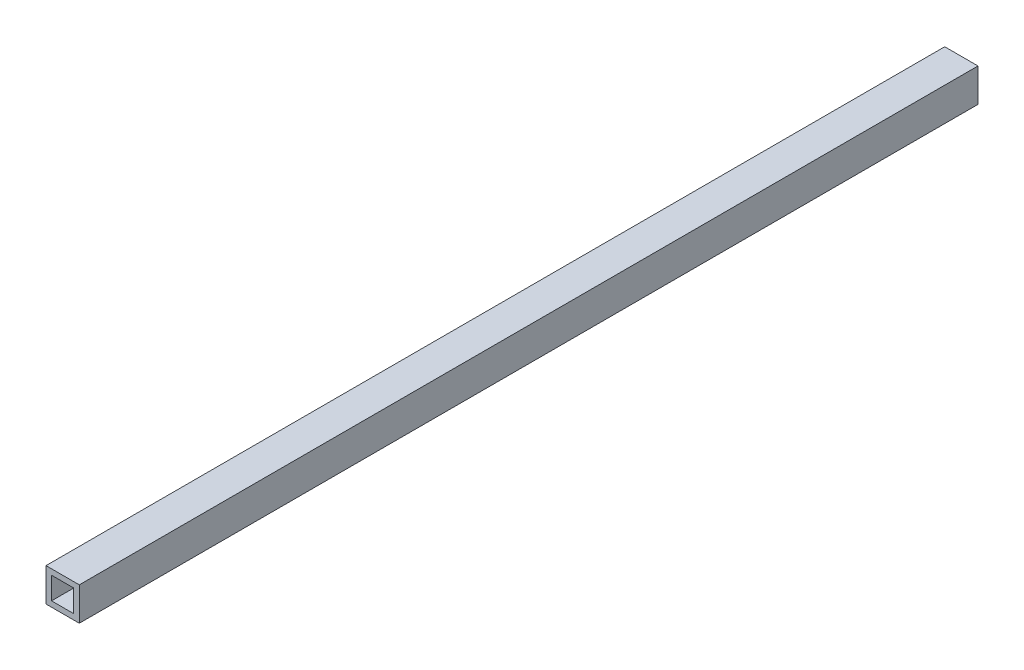
ISO-10303-21;
HEADER;
FILE_DESCRIPTION(('STEP AP214'),'2;1');
FILE_NAME('part.step','',(''),(''),'','','');
FILE_SCHEMA(('AUTOMOTIVE_DESIGN { 1 0 10303 214 1 1 1 1 }'));
ENDSEC;
DATA;
#1=APPLICATION_CONTEXT('core data for automotive mechanical design processes');
#2=APPLICATION_PROTOCOL_DEFINITION('international standard','automotive_design',2000,#1);
#3=PRODUCT_CONTEXT('',#1,'mechanical');
#4=PRODUCT('Part','Part','',(#3));
#5=PRODUCT_RELATED_PRODUCT_CATEGORY('part','',(#4));
#6=PRODUCT_DEFINITION_FORMATION('','',#4);
#7=PRODUCT_DEFINITION_CONTEXT('part definition',#1,'design');
#8=PRODUCT_DEFINITION('design','',#6,#7);
#9=PRODUCT_DEFINITION_SHAPE('','',#8);
#10=(LENGTH_UNIT() NAMED_UNIT(*) SI_UNIT(.MILLI.,.METRE.));
#11=(NAMED_UNIT(*) PLANE_ANGLE_UNIT() SI_UNIT($,.RADIAN.));
#12=(NAMED_UNIT(*) SI_UNIT($,.STERADIAN.) SOLID_ANGLE_UNIT());
#13=UNCERTAINTY_MEASURE_WITH_UNIT(LENGTH_MEASURE(1.E-05),#10,'distance_accuracy_value','');
#14=(GEOMETRIC_REPRESENTATION_CONTEXT(3) GLOBAL_UNCERTAINTY_ASSIGNED_CONTEXT((#13)) GLOBAL_UNIT_ASSIGNED_CONTEXT((#10,
#11,#12)) REPRESENTATION_CONTEXT('',''));
#15=CARTESIAN_POINT('',(0.,0.,0.));
#16=DIRECTION('',(0.,0.,1.));
#17=DIRECTION('',(1.,0.,0.));
#18=AXIS2_PLACEMENT_3D('',#15,#16,#17);
#19=CARTESIAN_POINT('',(9.52500000000001,-9.52499999999999,-514.35));
#20=DIRECTION('',(1.,0.,0.));
#21=DIRECTION('',(0.,0.,-1.));
#22=AXIS2_PLACEMENT_3D('',#19,#20,#21);
#23=PLANE('',#22);
#24=DIRECTION('',(0.,1.,0.));
#25=VECTOR('',#24,1.);
#26=CARTESIAN_POINT('',(9.52500000000001,-9.52499999999999,0.));
#27=LINE('',#26,#25);
#28=CARTESIAN_POINT('',(9.52500000000001,-9.52499999999999,0.));
#29=VERTEX_POINT('',#28);
#30=CARTESIAN_POINT('',(9.52500000000001,9.52500000000001,0.));
#31=VERTEX_POINT('',#30);
#32=EDGE_CURVE('E104',#29,#31,#27,.T.);
#33=ORIENTED_EDGE('',*,*,#32,.F.);
#34=DIRECTION('',(0.,0.,1.));
#35=VECTOR('',#34,1.);
#36=CARTESIAN_POINT('',(9.52500000000001,-9.52499999999999,-514.35));
#37=LINE('',#36,#35);
#38=CARTESIAN_POINT('',(9.52500000000001,-9.52499999999999,-514.35));
#39=VERTEX_POINT('',#38);
#40=EDGE_CURVE('E11',#39,#29,#37,.T.);
#41=ORIENTED_EDGE('',*,*,#40,.F.);
#42=DIRECTION('',(0.,1.,0.));
#43=VECTOR('',#42,1.);
#44=CARTESIAN_POINT('',(9.52500000000001,-9.52499999999999,-514.35));
#45=LINE('',#44,#43);
#46=CARTESIAN_POINT('',(9.52500000000001,9.52500000000001,-514.35));
#47=VERTEX_POINT('',#46);
#48=EDGE_CURVE('E133',#39,#47,#45,.T.);
#49=ORIENTED_EDGE('',*,*,#48,.T.);
#50=DIRECTION('',(0.,0.,1.));
#51=VECTOR('',#50,1.);
#52=CARTESIAN_POINT('',(9.52500000000001,9.52500000000001,-514.35));
#53=LINE('',#52,#51);
#54=EDGE_CURVE('E36',#47,#31,#53,.T.);
#55=ORIENTED_EDGE('',*,*,#54,.T.);
#56=EDGE_LOOP('',(#33,#41,#49,#55));
#57=FACE_BOUND('',#56,.T.);
#58=ADVANCED_FACE('F33',(#57),#23,.T.);
#59=CARTESIAN_POINT('',(-9.525,-9.52499999999999,-514.35));
#60=DIRECTION('',(0.,-1.,0.));
#61=DIRECTION('',(0.,0.,-1.));
#62=AXIS2_PLACEMENT_3D('',#59,#60,#61);
#63=PLANE('',#62);
#64=DIRECTION('',(1.,0.,0.));
#65=VECTOR('',#64,1.);
#66=CARTESIAN_POINT('',(-9.525,-9.52499999999999,0.));
#67=LINE('',#66,#65);
#68=CARTESIAN_POINT('',(-9.525,-9.52499999999999,0.));
#69=VERTEX_POINT('',#68);
#70=EDGE_CURVE('E137',#69,#29,#67,.T.);
#71=ORIENTED_EDGE('',*,*,#70,.F.);
#72=DIRECTION('',(0.,0.,1.));
#73=VECTOR('',#72,1.);
#74=CARTESIAN_POINT('',(-9.525,-9.52499999999999,-514.35));
#75=LINE('',#74,#73);
#76=CARTESIAN_POINT('',(-9.525,-9.52499999999999,-514.35));
#77=VERTEX_POINT('',#76);
#78=EDGE_CURVE('E41',#77,#69,#75,.T.);
#79=ORIENTED_EDGE('',*,*,#78,.F.);
#80=DIRECTION('',(1.,0.,0.));
#81=VECTOR('',#80,1.);
#82=CARTESIAN_POINT('',(-9.525,-9.52499999999999,-514.35));
#83=LINE('',#82,#81);
#84=EDGE_CURVE('E143',#77,#39,#83,.T.);
#85=ORIENTED_EDGE('',*,*,#84,.T.);
#86=ORIENTED_EDGE('',*,*,#40,.T.);
#87=EDGE_LOOP('',(#71,#79,#85,#86));
#88=FACE_BOUND('',#87,.T.);
#89=ADVANCED_FACE('F169',(#88),#63,.T.);
#90=CARTESIAN_POINT('',(-9.525,-9.52499999999999,-514.35));
#91=DIRECTION('',(-1.,0.,0.));
#92=DIRECTION('',(0.,0.,1.));
#93=AXIS2_PLACEMENT_3D('',#90,#91,#92);
#94=PLANE('',#93);
#95=DIRECTION('',(0.,-1.,0.));
#96=VECTOR('',#95,1.);
#97=CARTESIAN_POINT('',(-9.525,-9.52499999999999,0.));
#98=LINE('',#97,#96);
#99=CARTESIAN_POINT('',(-9.525,9.52500000000001,0.));
#100=VERTEX_POINT('',#99);
#101=EDGE_CURVE('E151',#100,#69,#98,.T.);
#102=ORIENTED_EDGE('',*,*,#101,.F.);
#103=DIRECTION('',(0.,0.,1.));
#104=VECTOR('',#103,1.);
#105=CARTESIAN_POINT('',(-9.525,9.52500000000001,-514.35));
#106=LINE('',#105,#104);
#107=CARTESIAN_POINT('',(-9.525,9.52500000000001,-514.35));
#108=VERTEX_POINT('',#107);
#109=EDGE_CURVE('E156',#108,#100,#106,.T.);
#110=ORIENTED_EDGE('',*,*,#109,.F.);
#111=DIRECTION('',(0.,-1.,0.));
#112=VECTOR('',#111,1.);
#113=CARTESIAN_POINT('',(-9.525,-9.52499999999999,-514.35));
#114=LINE('',#113,#112);
#115=EDGE_CURVE('E140',#108,#77,#114,.T.);
#116=ORIENTED_EDGE('',*,*,#115,.T.);
#117=ORIENTED_EDGE('',*,*,#78,.T.);
#118=EDGE_LOOP('',(#102,#110,#116,#117));
#119=FACE_BOUND('',#118,.T.);
#120=ADVANCED_FACE('F173',(#119),#94,.T.);
#121=CARTESIAN_POINT('',(-9.525,9.52500000000001,-514.35));
#122=DIRECTION('',(0.,1.,0.));
#123=DIRECTION('',(0.,0.,1.));
#124=AXIS2_PLACEMENT_3D('',#121,#122,#123);
#125=PLANE('',#124);
#126=DIRECTION('',(-1.,0.,0.));
#127=VECTOR('',#126,1.);
#128=CARTESIAN_POINT('',(-9.525,9.52500000000001,0.));
#129=LINE('',#128,#127);
#130=EDGE_CURVE('E148',#31,#100,#129,.T.);
#131=ORIENTED_EDGE('',*,*,#130,.F.);
#132=ORIENTED_EDGE('',*,*,#54,.F.);
#133=DIRECTION('',(-1.,0.,0.));
#134=VECTOR('',#133,1.);
#135=CARTESIAN_POINT('',(-9.525,9.52500000000001,-514.35));
#136=LINE('',#135,#134);
#137=EDGE_CURVE('E136',#47,#108,#136,.T.);
#138=ORIENTED_EDGE('',*,*,#137,.T.);
#139=ORIENTED_EDGE('',*,*,#109,.T.);
#140=EDGE_LOOP('',(#131,#132,#138,#139));
#141=FACE_BOUND('',#140,.T.);
#142=ADVANCED_FACE('F164',(#141),#125,.T.);
#143=CARTESIAN_POINT('',(0.,0.,-514.35));
#144=DIRECTION('',(0.,0.,-1.));
#145=DIRECTION('',(-1.,0.,0.));
#146=AXIS2_PLACEMENT_3D('',#143,#144,#145);
#147=PLANE('',#146);
#148=DIRECTION('',(0.,1.,0.));
#149=VECTOR('',#148,1.);
#150=CARTESIAN_POINT('',(6.35,-6.35,-514.35));
#151=LINE('',#150,#149);
#152=CARTESIAN_POINT('',(6.35,-6.35,-514.35));
#153=VERTEX_POINT('',#152);
#154=CARTESIAN_POINT('',(6.35,6.35,-514.35));
#155=VERTEX_POINT('',#154);
#156=EDGE_CURVE('E108',#153,#155,#151,.T.);
#157=ORIENTED_EDGE('',*,*,#156,.T.);
#158=DIRECTION('',(-1.,0.,0.));
#159=VECTOR('',#158,1.);
#160=CARTESIAN_POINT('',(-6.35,6.35,-514.35));
#161=LINE('',#160,#159);
#162=CARTESIAN_POINT('',(-6.35,6.35,-514.35));
#163=VERTEX_POINT('',#162);
#164=EDGE_CURVE('E97',#155,#163,#161,.T.);
#165=ORIENTED_EDGE('',*,*,#164,.T.);
#166=DIRECTION('',(0.,-1.,0.));
#167=VECTOR('',#166,1.);
#168=CARTESIAN_POINT('',(-6.35,-6.35,-514.35));
#169=LINE('',#168,#167);
#170=CARTESIAN_POINT('',(-6.35,-6.35,-514.35));
#171=VERTEX_POINT('',#170);
#172=EDGE_CURVE('E119',#163,#171,#169,.T.);
#173=ORIENTED_EDGE('',*,*,#172,.T.);
#174=DIRECTION('',(1.,0.,0.));
#175=VECTOR('',#174,1.);
#176=CARTESIAN_POINT('',(-6.35,-6.35,-514.35));
#177=LINE('',#176,#175);
#178=EDGE_CURVE('E115',#171,#153,#177,.T.);
#179=ORIENTED_EDGE('',*,*,#178,.T.);
#180=EDGE_LOOP('',(#157,#165,#173,#179));
#181=FACE_BOUND('',#180,.T.);
#182=ORIENTED_EDGE('',*,*,#48,.F.);
#183=ORIENTED_EDGE('',*,*,#84,.F.);
#184=ORIENTED_EDGE('',*,*,#115,.F.);
#185=ORIENTED_EDGE('',*,*,#137,.F.);
#186=EDGE_LOOP('',(#182,#183,#184,#185));
#187=FACE_BOUND('',#186,.T.);
#188=ADVANCED_FACE('F113',(#181,#187),#147,.T.);
#189=CARTESIAN_POINT('',(0.,0.,0.));
#190=DIRECTION('',(0.,0.,-1.));
#191=DIRECTION('',(-1.,0.,0.));
#192=AXIS2_PLACEMENT_3D('',#189,#190,#191);
#193=PLANE('',#192);
#194=DIRECTION('',(-1.,0.,0.));
#195=VECTOR('',#194,1.);
#196=CARTESIAN_POINT('',(-6.35,6.35,0.));
#197=LINE('',#196,#195);
#198=CARTESIAN_POINT('',(6.35,6.35,0.));
#199=VERTEX_POINT('',#198);
#200=CARTESIAN_POINT('',(-6.35,6.35,0.));
#201=VERTEX_POINT('',#200);
#202=EDGE_CURVE('E117',#199,#201,#197,.T.);
#203=ORIENTED_EDGE('',*,*,#202,.F.);
#204=DIRECTION('',(0.,1.,0.));
#205=VECTOR('',#204,1.);
#206=CARTESIAN_POINT('',(6.35,-6.35,0.));
#207=LINE('',#206,#205);
#208=CARTESIAN_POINT('',(6.35,-6.35,0.));
#209=VERTEX_POINT('',#208);
#210=EDGE_CURVE('E57',#209,#199,#207,.T.);
#211=ORIENTED_EDGE('',*,*,#210,.F.);
#212=DIRECTION('',(1.,0.,0.));
#213=VECTOR('',#212,1.);
#214=CARTESIAN_POINT('',(-6.35,-6.35,0.));
#215=LINE('',#214,#213);
#216=CARTESIAN_POINT('',(-6.35,-6.35,0.));
#217=VERTEX_POINT('',#216);
#218=EDGE_CURVE('E110',#217,#209,#215,.T.);
#219=ORIENTED_EDGE('',*,*,#218,.F.);
#220=DIRECTION('',(0.,-1.,0.));
#221=VECTOR('',#220,1.);
#222=CARTESIAN_POINT('',(-6.35,-6.35,0.));
#223=LINE('',#222,#221);
#224=EDGE_CURVE('E124',#201,#217,#223,.T.);
#225=ORIENTED_EDGE('',*,*,#224,.F.);
#226=EDGE_LOOP('',(#203,#211,#219,#225));
#227=FACE_BOUND('',#226,.T.);
#228=ORIENTED_EDGE('',*,*,#32,.T.);
#229=ORIENTED_EDGE('',*,*,#130,.T.);
#230=ORIENTED_EDGE('',*,*,#101,.T.);
#231=ORIENTED_EDGE('',*,*,#70,.T.);
#232=EDGE_LOOP('',(#228,#229,#230,#231));
#233=FACE_BOUND('',#232,.T.);
#234=ADVANCED_FACE('F166',(#227,#233),#193,.F.);
#235=CARTESIAN_POINT('',(6.35,-6.35,-514.351));
#236=DIRECTION('',(1.,0.,0.));
#237=DIRECTION('',(0.,0.,-1.));
#238=AXIS2_PLACEMENT_3D('',#235,#236,#237);
#239=PLANE('',#238);
#240=DIRECTION('',(0.,0.,1.));
#241=VECTOR('',#240,1.);
#242=CARTESIAN_POINT('',(6.35,-6.35,-514.351));
#243=LINE('',#242,#241);
#244=EDGE_CURVE('E105',#153,#209,#243,.T.);
#245=ORIENTED_EDGE('',*,*,#244,.T.);
#246=ORIENTED_EDGE('',*,*,#210,.T.);
#247=DIRECTION('',(0.,0.,1.));
#248=VECTOR('',#247,1.);
#249=CARTESIAN_POINT('',(6.35,6.35,-514.351));
#250=LINE('',#249,#248);
#251=EDGE_CURVE('E99',#155,#199,#250,.T.);
#252=ORIENTED_EDGE('',*,*,#251,.F.);
#253=ORIENTED_EDGE('',*,*,#156,.F.);
#254=EDGE_LOOP('',(#245,#246,#252,#253));
#255=FACE_BOUND('',#254,.T.);
#256=ADVANCED_FACE('F107',(#255),#239,.F.);
#257=CARTESIAN_POINT('',(-6.35,-6.35,-514.351));
#258=DIRECTION('',(0.,-1.,0.));
#259=DIRECTION('',(0.,0.,-1.));
#260=AXIS2_PLACEMENT_3D('',#257,#258,#259);
#261=PLANE('',#260);
#262=DIRECTION('',(0.,0.,1.));
#263=VECTOR('',#262,1.);
#264=CARTESIAN_POINT('',(-6.35,-6.35,-514.351));
#265=LINE('',#264,#263);
#266=EDGE_CURVE('E130',#171,#217,#265,.T.);
#267=ORIENTED_EDGE('',*,*,#266,.T.);
#268=ORIENTED_EDGE('',*,*,#218,.T.);
#269=ORIENTED_EDGE('',*,*,#244,.F.);
#270=ORIENTED_EDGE('',*,*,#178,.F.);
#271=EDGE_LOOP('',(#267,#268,#269,#270));
#272=FACE_BOUND('',#271,.T.);
#273=ADVANCED_FACE('F224',(#272),#261,.F.);
#274=CARTESIAN_POINT('',(-6.35,-6.35,-514.351));
#275=DIRECTION('',(-1.,0.,0.));
#276=DIRECTION('',(0.,0.,1.));
#277=AXIS2_PLACEMENT_3D('',#274,#275,#276);
#278=PLANE('',#277);
#279=DIRECTION('',(0.,0.,1.));
#280=VECTOR('',#279,1.);
#281=CARTESIAN_POINT('',(-6.35,6.35,-514.351));
#282=LINE('',#281,#280);
#283=EDGE_CURVE('E49',#163,#201,#282,.T.);
#284=ORIENTED_EDGE('',*,*,#283,.T.);
#285=ORIENTED_EDGE('',*,*,#224,.T.);
#286=ORIENTED_EDGE('',*,*,#266,.F.);
#287=ORIENTED_EDGE('',*,*,#172,.F.);
#288=EDGE_LOOP('',(#284,#285,#286,#287));
#289=FACE_BOUND('',#288,.T.);
#290=ADVANCED_FACE('F233',(#289),#278,.F.);
#291=CARTESIAN_POINT('',(-6.35,6.35,-514.351));
#292=DIRECTION('',(0.,1.,0.));
#293=DIRECTION('',(0.,0.,1.));
#294=AXIS2_PLACEMENT_3D('',#291,#292,#293);
#295=PLANE('',#294);
#296=ORIENTED_EDGE('',*,*,#251,.T.);
#297=ORIENTED_EDGE('',*,*,#202,.T.);
#298=ORIENTED_EDGE('',*,*,#283,.F.);
#299=ORIENTED_EDGE('',*,*,#164,.F.);
#300=EDGE_LOOP('',(#296,#297,#298,#299));
#301=FACE_BOUND('',#300,.T.);
#302=ADVANCED_FACE('F98',(#301),#295,.F.);
#303=CLOSED_SHELL('',(#58,#89,#120,#142,#188,#234,#256,#273,#290,#302));
#304=MANIFOLD_SOLID_BREP('B2',#303);
#305=ADVANCED_BREP_SHAPE_REPRESENTATION('',(#18,#304),#14);
#306=SHAPE_DEFINITION_REPRESENTATION(#9,#305);
ENDSEC;
END-ISO-10303-21;
